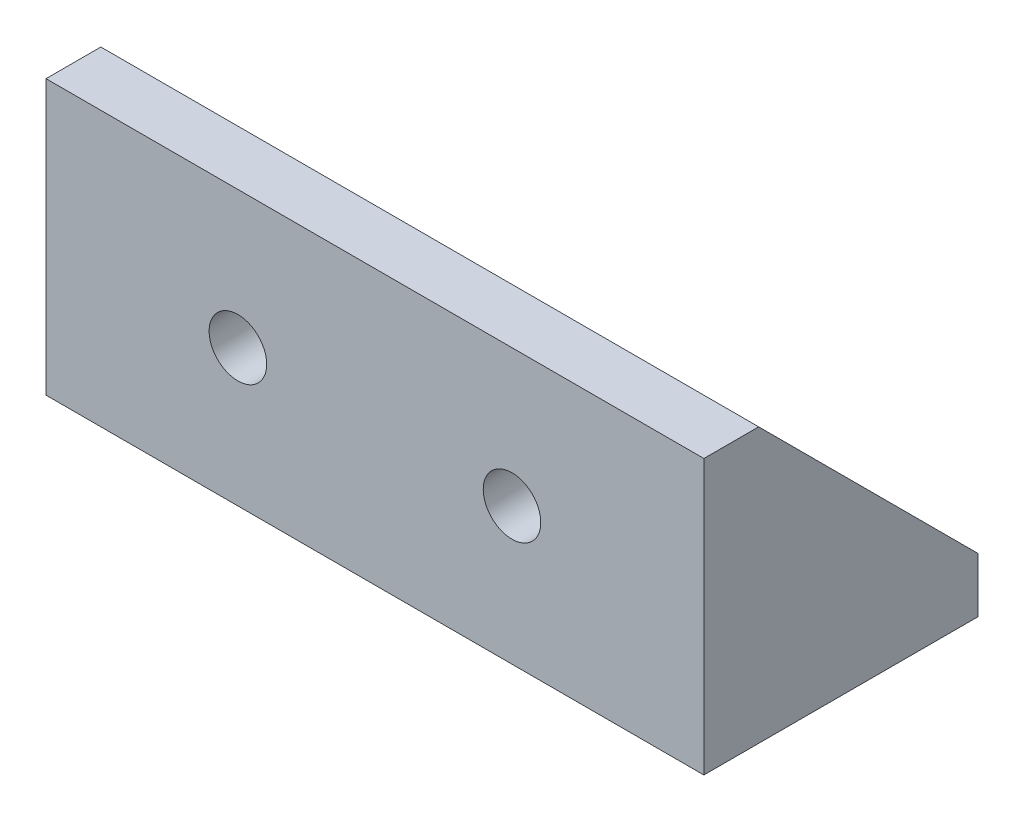
ISO-10303-21;
HEADER;
FILE_DESCRIPTION(('STEP AP214'),'2;1');
FILE_NAME('part.step','',(''),(''),'','','');
FILE_SCHEMA(('AUTOMOTIVE_DESIGN { 1 0 10303 214 1 1 1 1 }'));
ENDSEC;
DATA;
#1=APPLICATION_CONTEXT('core data for automotive mechanical design processes');
#2=APPLICATION_PROTOCOL_DEFINITION('international standard','automotive_design',2000,#1);
#3=PRODUCT_CONTEXT('',#1,'mechanical');
#4=PRODUCT('Part','Part','',(#3));
#5=PRODUCT_RELATED_PRODUCT_CATEGORY('part','',(#4));
#6=PRODUCT_DEFINITION_FORMATION('','',#4);
#7=PRODUCT_DEFINITION_CONTEXT('part definition',#1,'design');
#8=PRODUCT_DEFINITION('design','',#6,#7);
#9=PRODUCT_DEFINITION_SHAPE('','',#8);
#10=(LENGTH_UNIT() NAMED_UNIT(*) SI_UNIT(.MILLI.,.METRE.));
#11=(NAMED_UNIT(*) PLANE_ANGLE_UNIT() SI_UNIT($,.RADIAN.));
#12=(NAMED_UNIT(*) SI_UNIT($,.STERADIAN.) SOLID_ANGLE_UNIT());
#13=UNCERTAINTY_MEASURE_WITH_UNIT(LENGTH_MEASURE(1.E-05),#10,'distance_accuracy_value','');
#14=(GEOMETRIC_REPRESENTATION_CONTEXT(3) GLOBAL_UNCERTAINTY_ASSIGNED_CONTEXT((#13)) GLOBAL_UNIT_ASSIGNED_CONTEXT((#10,
#11,#12)) REPRESENTATION_CONTEXT('',''));
#15=CARTESIAN_POINT('',(0.,0.,0.));
#16=DIRECTION('',(0.,0.,1.));
#17=DIRECTION('',(1.,0.,0.));
#18=AXIS2_PLACEMENT_3D('',#15,#16,#17);
#19=CARTESIAN_POINT('',(0.,4.,0.));
#20=DIRECTION('',(0.,-1.,0.));
#21=DIRECTION('',(0.,0.,-1.));
#22=AXIS2_PLACEMENT_3D('',#19,#20,#21);
#23=PLANE('',#22);
#24=CARTESIAN_POINT('',(30.,4.,-10.));
#25=DIRECTION('',(0.,-1.,0.));
#26=DIRECTION('',(0.,0.,-1.));
#27=AXIS2_PLACEMENT_3D('',#24,#25,#26);
#28=CIRCLE('',#27,3.1);
#29=CARTESIAN_POINT('',(30.,4.,-13.1));
#30=VERTEX_POINT('',#29);
#31=EDGE_CURVE('E55',#30,#30,#28,.T.);
#32=ORIENTED_EDGE('',*,*,#31,.T.);
#33=EDGE_LOOP('',(#32));
#34=FACE_BOUND('',#33,.T.);
#35=CARTESIAN_POINT('',(10.,4.,-10.));
#36=DIRECTION('',(0.,-1.,0.));
#37=DIRECTION('',(0.,0.,-1.));
#38=AXIS2_PLACEMENT_3D('',#35,#36,#37);
#39=CIRCLE('',#38,3.1);
#40=CARTESIAN_POINT('',(10.,4.,-13.1));
#41=VERTEX_POINT('',#40);
#42=EDGE_CURVE('E247',#41,#41,#39,.T.);
#43=ORIENTED_EDGE('',*,*,#42,.T.);
#44=EDGE_LOOP('',(#43));
#45=FACE_BOUND('',#44,.T.);
#46=DIRECTION('',(-1.,0.,0.));
#47=VECTOR('',#46,1.);
#48=CARTESIAN_POINT('',(0.,4.,-4.));
#49=LINE('',#48,#47);
#50=CARTESIAN_POINT('',(40.,4.,-4.));
#51=VERTEX_POINT('',#50);
#52=CARTESIAN_POINT('',(0.,4.,-4.));
#53=VERTEX_POINT('',#52);
#54=EDGE_CURVE('E62',#51,#53,#49,.T.);
#55=ORIENTED_EDGE('',*,*,#54,.F.);
#56=DIRECTION('',(0.,0.,-1.));
#57=VECTOR('',#56,1.);
#58=CARTESIAN_POINT('',(40.,4.,0.));
#59=LINE('',#58,#57);
#60=CARTESIAN_POINT('',(40.,4.,-20.));
#61=VERTEX_POINT('',#60);
#62=EDGE_CURVE('E222',#51,#61,#59,.T.);
#63=ORIENTED_EDGE('',*,*,#62,.T.);
#64=DIRECTION('',(1.,0.,0.));
#65=VECTOR('',#64,1.);
#66=CARTESIAN_POINT('',(0.,4.,-20.));
#67=LINE('',#66,#65);
#68=CARTESIAN_POINT('',(0.,4.,-20.));
#69=VERTEX_POINT('',#68);
#70=EDGE_CURVE('E218',#69,#61,#67,.T.);
#71=ORIENTED_EDGE('',*,*,#70,.F.);
#72=DIRECTION('',(0.,0.,-1.));
#73=VECTOR('',#72,1.);
#74=CARTESIAN_POINT('',(0.,4.,0.));
#75=LINE('',#74,#73);
#76=EDGE_CURVE('E67',#53,#69,#75,.T.);
#77=ORIENTED_EDGE('',*,*,#76,.F.);
#78=EDGE_LOOP('',(#55,#63,#71,#77));
#79=FACE_BOUND('',#78,.T.);
#80=ADVANCED_FACE('F45',(#34,#45,#79),#23,.F.);
#81=CARTESIAN_POINT('',(0.,4.,0.));
#82=DIRECTION('',(0.,0.,-1.));
#83=DIRECTION('',(-1.,0.,0.));
#84=AXIS2_PLACEMENT_3D('',#81,#82,#83);
#85=PLANE('',#84);
#86=CARTESIAN_POINT('',(30.,10.,0.));
#87=DIRECTION('',(0.,0.,-1.));
#88=DIRECTION('',(-1.,0.,0.));
#89=AXIS2_PLACEMENT_3D('',#86,#87,#88);
#90=CIRCLE('',#89,2.1);
#91=CARTESIAN_POINT('',(27.9,10.,0.));
#92=VERTEX_POINT('',#91);
#93=EDGE_CURVE('E186',#92,#92,#90,.T.);
#94=ORIENTED_EDGE('',*,*,#93,.T.);
#95=EDGE_LOOP('',(#94));
#96=FACE_BOUND('',#95,.T.);
#97=CARTESIAN_POINT('',(10.,10.,0.));
#98=DIRECTION('',(0.,0.,-1.));
#99=DIRECTION('',(-1.,0.,0.));
#100=AXIS2_PLACEMENT_3D('',#97,#98,#99);
#101=CIRCLE('',#100,2.1);
#102=CARTESIAN_POINT('',(7.9,10.,0.));
#103=VERTEX_POINT('',#102);
#104=EDGE_CURVE('E185',#103,#103,#101,.T.);
#105=ORIENTED_EDGE('',*,*,#104,.T.);
#106=EDGE_LOOP('',(#105));
#107=FACE_BOUND('',#106,.T.);
#108=DIRECTION('',(1.,0.,0.));
#109=VECTOR('',#108,1.);
#110=CARTESIAN_POINT('',(0.,0.,0.));
#111=LINE('',#110,#109);
#112=CARTESIAN_POINT('',(-4.,0.,0.));
#113=VERTEX_POINT('',#112);
#114=CARTESIAN_POINT('',(44.,0.,0.));
#115=VERTEX_POINT('',#114);
#116=EDGE_CURVE('E110',#113,#115,#111,.T.);
#117=ORIENTED_EDGE('',*,*,#116,.T.);
#118=DIRECTION('',(0.,-1.,0.));
#119=VECTOR('',#118,1.);
#120=CARTESIAN_POINT('',(44.,0.,0.));
#121=LINE('',#120,#119);
#122=CARTESIAN_POINT('',(44.,20.,0.));
#123=VERTEX_POINT('',#122);
#124=EDGE_CURVE('E114',#123,#115,#121,.T.);
#125=ORIENTED_EDGE('',*,*,#124,.F.);
#126=DIRECTION('',(1.,0.,0.));
#127=VECTOR('',#126,1.);
#128=CARTESIAN_POINT('',(0.,20.,0.));
#129=LINE('',#128,#127);
#130=CARTESIAN_POINT('',(-4.,20.,0.));
#131=VERTEX_POINT('',#130);
#132=EDGE_CURVE('E190',#131,#123,#129,.T.);
#133=ORIENTED_EDGE('',*,*,#132,.F.);
#134=DIRECTION('',(0.,1.,0.));
#135=VECTOR('',#134,1.);
#136=CARTESIAN_POINT('',(-4.,20.,0.));
#137=LINE('',#136,#135);
#138=EDGE_CURVE('E116',#113,#131,#137,.T.);
#139=ORIENTED_EDGE('',*,*,#138,.F.);
#140=EDGE_LOOP('',(#117,#125,#133,#139));
#141=FACE_BOUND('',#140,.T.);
#142=ADVANCED_FACE('F112',(#96,#107,#141),#85,.F.);
#143=CARTESIAN_POINT('',(0.,4.,-20.));
#144=DIRECTION('',(0.,0.,-1.));
#145=DIRECTION('',(-1.,0.,0.));
#146=AXIS2_PLACEMENT_3D('',#143,#144,#145);
#147=PLANE('',#146);
#148=DIRECTION('',(1.,0.,0.));
#149=VECTOR('',#148,1.);
#150=CARTESIAN_POINT('',(0.,0.,-20.));
#151=LINE('',#150,#149);
#152=CARTESIAN_POINT('',(-4.,0.,-20.));
#153=VERTEX_POINT('',#152);
#154=CARTESIAN_POINT('',(44.,0.,-20.));
#155=VERTEX_POINT('',#154);
#156=EDGE_CURVE('E121',#153,#155,#151,.T.);
#157=ORIENTED_EDGE('',*,*,#156,.F.);
#158=DIRECTION('',(0.,-1.,0.));
#159=VECTOR('',#158,1.);
#160=CARTESIAN_POINT('',(-4.,0.,-20.));
#161=LINE('',#160,#159);
#162=CARTESIAN_POINT('',(-4.,4.,-20.));
#163=VERTEX_POINT('',#162);
#164=EDGE_CURVE('E159',#163,#153,#161,.T.);
#165=ORIENTED_EDGE('',*,*,#164,.F.);
#166=DIRECTION('',(1.,0.,0.));
#167=VECTOR('',#166,1.);
#168=CARTESIAN_POINT('',(-4.,4.,-20.));
#169=LINE('',#168,#167);
#170=EDGE_CURVE('E174',#163,#69,#169,.T.);
#171=ORIENTED_EDGE('',*,*,#170,.T.);
#172=ORIENTED_EDGE('',*,*,#70,.T.);
#173=DIRECTION('',(-1.,0.,0.));
#174=VECTOR('',#173,1.);
#175=CARTESIAN_POINT('',(44.,4.,-20.));
#176=LINE('',#175,#174);
#177=CARTESIAN_POINT('',(44.,4.,-20.));
#178=VERTEX_POINT('',#177);
#179=EDGE_CURVE('E154',#178,#61,#176,.T.);
#180=ORIENTED_EDGE('',*,*,#179,.F.);
#181=DIRECTION('',(0.,1.,0.));
#182=VECTOR('',#181,1.);
#183=CARTESIAN_POINT('',(44.,4.,-20.));
#184=LINE('',#183,#182);
#185=EDGE_CURVE('E130',#155,#178,#184,.T.);
#186=ORIENTED_EDGE('',*,*,#185,.F.);
#187=EDGE_LOOP('',(#157,#165,#171,#172,#180,#186));
#188=FACE_BOUND('',#187,.T.);
#189=ADVANCED_FACE('F270',(#188),#147,.T.);
#190=CARTESIAN_POINT('',(0.,0.,0.));
#191=DIRECTION('',(0.,-1.,0.));
#192=DIRECTION('',(0.,0.,-1.));
#193=AXIS2_PLACEMENT_3D('',#190,#191,#192);
#194=PLANE('',#193);
#195=ORIENTED_EDGE('',*,*,#116,.F.);
#196=DIRECTION('',(0.,0.,1.));
#197=VECTOR('',#196,1.);
#198=CARTESIAN_POINT('',(-4.,0.,0.));
#199=LINE('',#198,#197);
#200=EDGE_CURVE('E163',#153,#113,#199,.T.);
#201=ORIENTED_EDGE('',*,*,#200,.F.);
#202=ORIENTED_EDGE('',*,*,#156,.T.);
#203=DIRECTION('',(0.,0.,-1.));
#204=VECTOR('',#203,1.);
#205=CARTESIAN_POINT('',(44.,0.,-20.));
#206=LINE('',#205,#204);
#207=EDGE_CURVE('E124',#115,#155,#206,.T.);
#208=ORIENTED_EDGE('',*,*,#207,.F.);
#209=EDGE_LOOP('',(#195,#201,#202,#208));
#210=FACE_BOUND('',#209,.T.);
#211=CARTESIAN_POINT('',(10.,0.,-10.));
#212=DIRECTION('',(0.,1.,0.));
#213=DIRECTION('',(0.,0.,1.));
#214=AXIS2_PLACEMENT_3D('',#211,#212,#213);
#215=CIRCLE('',#214,2.1);
#216=CARTESIAN_POINT('',(10.,0.,-7.9));
#217=VERTEX_POINT('',#216);
#218=EDGE_CURVE('E209',#217,#217,#215,.T.);
#219=ORIENTED_EDGE('',*,*,#218,.T.);
#220=EDGE_LOOP('',(#219));
#221=FACE_BOUND('',#220,.T.);
#222=CARTESIAN_POINT('',(30.,0.,-10.));
#223=DIRECTION('',(0.,1.,0.));
#224=DIRECTION('',(0.,0.,1.));
#225=AXIS2_PLACEMENT_3D('',#222,#223,#224);
#226=CIRCLE('',#225,2.1);
#227=CARTESIAN_POINT('',(30.,0.,-7.9));
#228=VERTEX_POINT('',#227);
#229=EDGE_CURVE('E208',#228,#228,#226,.T.);
#230=ORIENTED_EDGE('',*,*,#229,.T.);
#231=EDGE_LOOP('',(#230));
#232=FACE_BOUND('',#231,.T.);
#233=ADVANCED_FACE('F125',(#210,#221,#232),#194,.T.);
#234=CARTESIAN_POINT('',(30.,0.,-10.));
#235=DIRECTION('',(0.,1.,0.));
#236=DIRECTION('',(0.,0.,1.));
#237=AXIS2_PLACEMENT_3D('',#234,#235,#236);
#238=CYLINDRICAL_SURFACE('',#237,2.1);
#239=CARTESIAN_POINT('',(30.,3.00000000000001,-10.));
#240=DIRECTION('',(0.,-1.,0.));
#241=DIRECTION('',(0.,0.,-1.));
#242=AXIS2_PLACEMENT_3D('',#239,#240,#241);
#243=CIRCLE('',#242,2.1);
#244=CARTESIAN_POINT('',(30.,3.00000000000001,-12.1));
#245=VERTEX_POINT('',#244);
#246=EDGE_CURVE('E243',#245,#245,#243,.F.);
#247=ORIENTED_EDGE('',*,*,#246,.T.);
#248=EDGE_LOOP('',(#247));
#249=FACE_BOUND('',#248,.T.);
#250=ORIENTED_EDGE('',*,*,#229,.F.);
#251=EDGE_LOOP('',(#250));
#252=FACE_BOUND('',#251,.T.);
#253=ADVANCED_FACE('F262',(#249,#252),#238,.F.);
#254=CARTESIAN_POINT('',(10.,0.,-10.));
#255=DIRECTION('',(0.,1.,0.));
#256=DIRECTION('',(0.,0.,1.));
#257=AXIS2_PLACEMENT_3D('',#254,#255,#256);
#258=CYLINDRICAL_SURFACE('',#257,2.1);
#259=CARTESIAN_POINT('',(10.,3.,-10.));
#260=DIRECTION('',(0.,-1.,0.));
#261=DIRECTION('',(0.,0.,-1.));
#262=AXIS2_PLACEMENT_3D('',#259,#260,#261);
#263=CIRCLE('',#262,2.1);
#264=CARTESIAN_POINT('',(10.,3.,-12.1));
#265=VERTEX_POINT('',#264);
#266=EDGE_CURVE('E11',#265,#265,#263,.F.);
#267=ORIENTED_EDGE('',*,*,#266,.T.);
#268=EDGE_LOOP('',(#267));
#269=FACE_BOUND('',#268,.T.);
#270=ORIENTED_EDGE('',*,*,#218,.F.);
#271=EDGE_LOOP('',(#270));
#272=FACE_BOUND('',#271,.T.);
#273=ADVANCED_FACE('F265',(#269,#272),#258,.F.);
#274=CARTESIAN_POINT('',(0.,0.,-4.));
#275=DIRECTION('',(0.,0.,1.));
#276=DIRECTION('',(1.,0.,0.));
#277=AXIS2_PLACEMENT_3D('',#274,#275,#276);
#278=PLANE('',#277);
#279=CARTESIAN_POINT('',(10.,10.,-4.));
#280=DIRECTION('',(0.,0.,1.));
#281=DIRECTION('',(1.,0.,0.));
#282=AXIS2_PLACEMENT_3D('',#279,#280,#281);
#283=CIRCLE('',#282,3.10000000000001);
#284=CARTESIAN_POINT('',(13.1,10.,-4.));
#285=VERTEX_POINT('',#284);
#286=EDGE_CURVE('E235',#285,#285,#283,.T.);
#287=ORIENTED_EDGE('',*,*,#286,.T.);
#288=EDGE_LOOP('',(#287));
#289=FACE_BOUND('',#288,.T.);
#290=CARTESIAN_POINT('',(30.,10.,-4.));
#291=DIRECTION('',(0.,0.,1.));
#292=DIRECTION('',(1.,0.,0.));
#293=AXIS2_PLACEMENT_3D('',#290,#291,#292);
#294=CIRCLE('',#293,3.10000000000002);
#295=CARTESIAN_POINT('',(33.1,10.,-4.));
#296=VERTEX_POINT('',#295);
#297=EDGE_CURVE('E231',#296,#296,#294,.T.);
#298=ORIENTED_EDGE('',*,*,#297,.T.);
#299=EDGE_LOOP('',(#298));
#300=FACE_BOUND('',#299,.T.);
#301=DIRECTION('',(0.,1.,0.));
#302=VECTOR('',#301,1.);
#303=CARTESIAN_POINT('',(40.,0.,-4.));
#304=LINE('',#303,#302);
#305=CARTESIAN_POINT('',(40.,20.,-4.));
#306=VERTEX_POINT('',#305);
#307=EDGE_CURVE('E197',#51,#306,#304,.T.);
#308=ORIENTED_EDGE('',*,*,#307,.F.);
#309=ORIENTED_EDGE('',*,*,#54,.T.);
#310=DIRECTION('',(0.,1.,0.));
#311=VECTOR('',#310,1.);
#312=CARTESIAN_POINT('',(0.,0.,-4.));
#313=LINE('',#312,#311);
#314=CARTESIAN_POINT('',(0.,20.,-4.));
#315=VERTEX_POINT('',#314);
#316=EDGE_CURVE('E201',#53,#315,#313,.T.);
#317=ORIENTED_EDGE('',*,*,#316,.T.);
#318=DIRECTION('',(1.,0.,0.));
#319=VECTOR('',#318,1.);
#320=CARTESIAN_POINT('',(0.,20.,-4.));
#321=LINE('',#320,#319);
#322=EDGE_CURVE('E194',#315,#306,#321,.T.);
#323=ORIENTED_EDGE('',*,*,#322,.T.);
#324=EDGE_LOOP('',(#308,#309,#317,#323));
#325=FACE_BOUND('',#324,.T.);
#326=ADVANCED_FACE('F287',(#289,#300,#325),#278,.F.);
#327=CARTESIAN_POINT('',(0.,20.,-4.));
#328=DIRECTION('',(0.,-1.,0.));
#329=DIRECTION('',(0.,0.,-1.));
#330=AXIS2_PLACEMENT_3D('',#327,#328,#329);
#331=PLANE('',#330);
#332=ORIENTED_EDGE('',*,*,#132,.T.);
#333=DIRECTION('',(0.,0.,1.));
#334=VECTOR('',#333,1.);
#335=CARTESIAN_POINT('',(44.,20.,0.));
#336=LINE('',#335,#334);
#337=CARTESIAN_POINT('',(44.,20.,-4.));
#338=VERTEX_POINT('',#337);
#339=EDGE_CURVE('E135',#338,#123,#336,.T.);
#340=ORIENTED_EDGE('',*,*,#339,.F.);
#341=DIRECTION('',(-1.,0.,0.));
#342=VECTOR('',#341,1.);
#343=CARTESIAN_POINT('',(44.,20.,-4.));
#344=LINE('',#343,#342);
#345=EDGE_CURVE('E149',#338,#306,#344,.T.);
#346=ORIENTED_EDGE('',*,*,#345,.T.);
#347=ORIENTED_EDGE('',*,*,#322,.F.);
#348=DIRECTION('',(1.,0.,0.));
#349=VECTOR('',#348,1.);
#350=CARTESIAN_POINT('',(-4.,20.,-4.));
#351=LINE('',#350,#349);
#352=CARTESIAN_POINT('',(-4.,20.,-4.));
#353=VERTEX_POINT('',#352);
#354=EDGE_CURVE('E181',#353,#315,#351,.T.);
#355=ORIENTED_EDGE('',*,*,#354,.F.);
#356=DIRECTION('',(0.,0.,-1.));
#357=VECTOR('',#356,1.);
#358=CARTESIAN_POINT('',(-4.,20.,-4.));
#359=LINE('',#358,#357);
#360=EDGE_CURVE('E168',#131,#353,#359,.T.);
#361=ORIENTED_EDGE('',*,*,#360,.F.);
#362=EDGE_LOOP('',(#332,#340,#346,#347,#355,#361));
#363=FACE_BOUND('',#362,.T.);
#364=ADVANCED_FACE('F289',(#363),#331,.F.);
#365=CARTESIAN_POINT('',(10.,10.,0.));
#366=DIRECTION('',(0.,0.,-1.));
#367=DIRECTION('',(-1.,0.,0.));
#368=AXIS2_PLACEMENT_3D('',#365,#366,#367);
#369=CYLINDRICAL_SURFACE('',#368,2.1);
#370=CARTESIAN_POINT('',(10.,10.,-3.));
#371=DIRECTION('',(0.,0.,1.));
#372=DIRECTION('',(1.,0.,0.));
#373=AXIS2_PLACEMENT_3D('',#370,#371,#372);
#374=CIRCLE('',#373,2.1);
#375=CARTESIAN_POINT('',(12.1,10.,-3.));
#376=VERTEX_POINT('',#375);
#377=EDGE_CURVE('E225',#376,#376,#374,.F.);
#378=ORIENTED_EDGE('',*,*,#377,.T.);
#379=EDGE_LOOP('',(#378));
#380=FACE_BOUND('',#379,.T.);
#381=ORIENTED_EDGE('',*,*,#104,.F.);
#382=EDGE_LOOP('',(#381));
#383=FACE_BOUND('',#382,.T.);
#384=ADVANCED_FACE('F292',(#380,#383),#369,.F.);
#385=CARTESIAN_POINT('',(30.,10.,0.));
#386=DIRECTION('',(0.,0.,-1.));
#387=DIRECTION('',(-1.,0.,0.));
#388=AXIS2_PLACEMENT_3D('',#385,#386,#387);
#389=CYLINDRICAL_SURFACE('',#388,2.1);
#390=CARTESIAN_POINT('',(30.,10.,-3.));
#391=DIRECTION('',(0.,0.,1.));
#392=DIRECTION('',(1.,0.,0.));
#393=AXIS2_PLACEMENT_3D('',#390,#391,#392);
#394=CIRCLE('',#393,2.1);
#395=CARTESIAN_POINT('',(32.1,10.,-3.));
#396=VERTEX_POINT('',#395);
#397=EDGE_CURVE('E239',#396,#396,#394,.F.);
#398=ORIENTED_EDGE('',*,*,#397,.T.);
#399=EDGE_LOOP('',(#398));
#400=FACE_BOUND('',#399,.T.);
#401=ORIENTED_EDGE('',*,*,#93,.F.);
#402=EDGE_LOOP('',(#401));
#403=FACE_BOUND('',#402,.T.);
#404=ADVANCED_FACE('F299',(#400,#403),#389,.F.);
#405=CARTESIAN_POINT('',(0.,0.,0.));
#406=DIRECTION('',(1.,0.,0.));
#407=DIRECTION('',(0.,0.,-1.));
#408=AXIS2_PLACEMENT_3D('',#405,#406,#407);
#409=PLANE('',#408);
#410=ORIENTED_EDGE('',*,*,#316,.F.);
#411=ORIENTED_EDGE('',*,*,#76,.T.);
#412=DIRECTION('',(0.,-0.707106781186548,-0.707106781186548));
#413=VECTOR('',#412,1.);
#414=CARTESIAN_POINT('',(0.,4.,-20.));
#415=LINE('',#414,#413);
#416=EDGE_CURVE('E158',#315,#69,#415,.T.);
#417=ORIENTED_EDGE('',*,*,#416,.F.);
#418=EDGE_LOOP('',(#410,#411,#417));
#419=FACE_BOUND('',#418,.T.);
#420=ADVANCED_FACE('F303',(#419),#409,.T.);
#421=CARTESIAN_POINT('',(-4.,4.,-20.));
#422=DIRECTION('',(0.,-0.707106781186547,0.707106781186547));
#423=DIRECTION('',(0.,-0.707106781186548,-0.707106781186548));
#424=AXIS2_PLACEMENT_3D('',#421,#422,#423);
#425=PLANE('',#424);
#426=ORIENTED_EDGE('',*,*,#416,.T.);
#427=ORIENTED_EDGE('',*,*,#170,.F.);
#428=DIRECTION('',(0.,-0.707106781186548,-0.707106781186548));
#429=VECTOR('',#428,1.);
#430=CARTESIAN_POINT('',(-4.,4.,-20.));
#431=LINE('',#430,#429);
#432=EDGE_CURVE('E171',#353,#163,#431,.T.);
#433=ORIENTED_EDGE('',*,*,#432,.F.);
#434=ORIENTED_EDGE('',*,*,#354,.T.);
#435=EDGE_LOOP('',(#426,#427,#433,#434));
#436=FACE_BOUND('',#435,.T.);
#437=ADVANCED_FACE('F305',(#436),#425,.F.);
#438=CARTESIAN_POINT('',(-4.,0.,0.));
#439=DIRECTION('',(1.,0.,0.));
#440=DIRECTION('',(0.,0.,-1.));
#441=AXIS2_PLACEMENT_3D('',#438,#439,#440);
#442=PLANE('',#441);
#443=ORIENTED_EDGE('',*,*,#164,.T.);
#444=ORIENTED_EDGE('',*,*,#200,.T.);
#445=ORIENTED_EDGE('',*,*,#138,.T.);
#446=ORIENTED_EDGE('',*,*,#360,.T.);
#447=ORIENTED_EDGE('',*,*,#432,.T.);
#448=EDGE_LOOP('',(#443,#444,#445,#446,#447));
#449=FACE_BOUND('',#448,.T.);
#450=ADVANCED_FACE('F308',(#449),#442,.F.);
#451=CARTESIAN_POINT('',(40.,0.,0.));
#452=DIRECTION('',(-1.,0.,0.));
#453=DIRECTION('',(0.,0.,1.));
#454=AXIS2_PLACEMENT_3D('',#451,#452,#453);
#455=PLANE('',#454);
#456=ORIENTED_EDGE('',*,*,#62,.F.);
#457=ORIENTED_EDGE('',*,*,#307,.T.);
#458=DIRECTION('',(0.,0.707106781186548,0.707106781186548));
#459=VECTOR('',#458,1.);
#460=CARTESIAN_POINT('',(40.,20.,-4.));
#461=LINE('',#460,#459);
#462=EDGE_CURVE('E137',#61,#306,#461,.T.);
#463=ORIENTED_EDGE('',*,*,#462,.F.);
#464=EDGE_LOOP('',(#456,#457,#463));
#465=FACE_BOUND('',#464,.T.);
#466=ADVANCED_FACE('F315',(#465),#455,.T.);
#467=CARTESIAN_POINT('',(44.,20.,-4.));
#468=DIRECTION('',(0.,-0.707106781186547,0.707106781186547));
#469=DIRECTION('',(0.,-0.707106781186548,-0.707106781186548));
#470=AXIS2_PLACEMENT_3D('',#467,#468,#469);
#471=PLANE('',#470);
#472=ORIENTED_EDGE('',*,*,#462,.T.);
#473=ORIENTED_EDGE('',*,*,#345,.F.);
#474=DIRECTION('',(0.,0.707106781186548,0.707106781186548));
#475=VECTOR('',#474,1.);
#476=CARTESIAN_POINT('',(44.,20.,-4.));
#477=LINE('',#476,#475);
#478=EDGE_CURVE('E145',#178,#338,#477,.T.);
#479=ORIENTED_EDGE('',*,*,#478,.F.);
#480=ORIENTED_EDGE('',*,*,#179,.T.);
#481=EDGE_LOOP('',(#472,#473,#479,#480));
#482=FACE_BOUND('',#481,.T.);
#483=ADVANCED_FACE('F317',(#482),#471,.F.);
#484=CARTESIAN_POINT('',(44.,0.,0.));
#485=DIRECTION('',(-1.,0.,0.));
#486=DIRECTION('',(0.,0.,1.));
#487=AXIS2_PLACEMENT_3D('',#484,#485,#486);
#488=PLANE('',#487);
#489=ORIENTED_EDGE('',*,*,#124,.T.);
#490=ORIENTED_EDGE('',*,*,#207,.T.);
#491=ORIENTED_EDGE('',*,*,#185,.T.);
#492=ORIENTED_EDGE('',*,*,#478,.T.);
#493=ORIENTED_EDGE('',*,*,#339,.T.);
#494=EDGE_LOOP('',(#489,#490,#491,#492,#493));
#495=FACE_BOUND('',#494,.T.);
#496=ADVANCED_FACE('F133',(#495),#488,.F.);
#497=CARTESIAN_POINT('',(10.,10.,-3.));
#498=DIRECTION('',(0.,0.,-1.));
#499=DIRECTION('',(-1.,0.,0.));
#500=AXIS2_PLACEMENT_3D('',#497,#498,#499);
#501=CONICAL_SURFACE('',#500,2.1,0.785398163397452);
#502=ORIENTED_EDGE('',*,*,#286,.F.);
#503=EDGE_LOOP('',(#502));
#504=FACE_BOUND('',#503,.T.);
#505=ORIENTED_EDGE('',*,*,#377,.F.);
#506=EDGE_LOOP('',(#505));
#507=FACE_BOUND('',#506,.T.);
#508=ADVANCED_FACE('F325',(#504,#507),#501,.F.);
#509=CARTESIAN_POINT('',(30.,10.,-3.));
#510=DIRECTION('',(0.,0.,-1.));
#511=DIRECTION('',(-1.,0.,0.));
#512=AXIS2_PLACEMENT_3D('',#509,#510,#511);
#513=CONICAL_SURFACE('',#512,2.1,0.785398163397453);
#514=ORIENTED_EDGE('',*,*,#297,.F.);
#515=EDGE_LOOP('',(#514));
#516=FACE_BOUND('',#515,.T.);
#517=ORIENTED_EDGE('',*,*,#397,.F.);
#518=EDGE_LOOP('',(#517));
#519=FACE_BOUND('',#518,.T.);
#520=ADVANCED_FACE('F259',(#516,#519),#513,.F.);
#521=CARTESIAN_POINT('',(30.,3.00000000000001,-10.));
#522=DIRECTION('',(0.,1.,0.));
#523=DIRECTION('',(0.,0.,1.));
#524=AXIS2_PLACEMENT_3D('',#521,#522,#523);
#525=CONICAL_SURFACE('',#524,2.1,0.785398163397448);
#526=ORIENTED_EDGE('',*,*,#31,.F.);
#527=EDGE_LOOP('',(#526));
#528=FACE_BOUND('',#527,.T.);
#529=ORIENTED_EDGE('',*,*,#246,.F.);
#530=EDGE_LOOP('',(#529));
#531=FACE_BOUND('',#530,.T.);
#532=ADVANCED_FACE('F256',(#528,#531),#525,.F.);
#533=CARTESIAN_POINT('',(10.,3.,-10.));
#534=DIRECTION('',(0.,1.,0.));
#535=DIRECTION('',(0.,0.,1.));
#536=AXIS2_PLACEMENT_3D('',#533,#534,#535);
#537=CONICAL_SURFACE('',#536,2.1,0.785398163397448);
#538=ORIENTED_EDGE('',*,*,#42,.F.);
#539=EDGE_LOOP('',(#538));
#540=FACE_BOUND('',#539,.T.);
#541=ORIENTED_EDGE('',*,*,#266,.F.);
#542=EDGE_LOOP('',(#541));
#543=FACE_BOUND('',#542,.T.);
#544=ADVANCED_FACE('F48',(#540,#543),#537,.F.);
#545=CLOSED_SHELL('',(#80,#142,#189,#233,#253,#273,#326,#364,#384,#404,#420,#437,#450,#466,#483,
#496,#508,#520,#532,#544));
#546=MANIFOLD_SOLID_BREP('B2',#545);
#547=ADVANCED_BREP_SHAPE_REPRESENTATION('',(#18,#546),#14);
#548=SHAPE_DEFINITION_REPRESENTATION(#9,#547);
ENDSEC;
END-ISO-10303-21;
